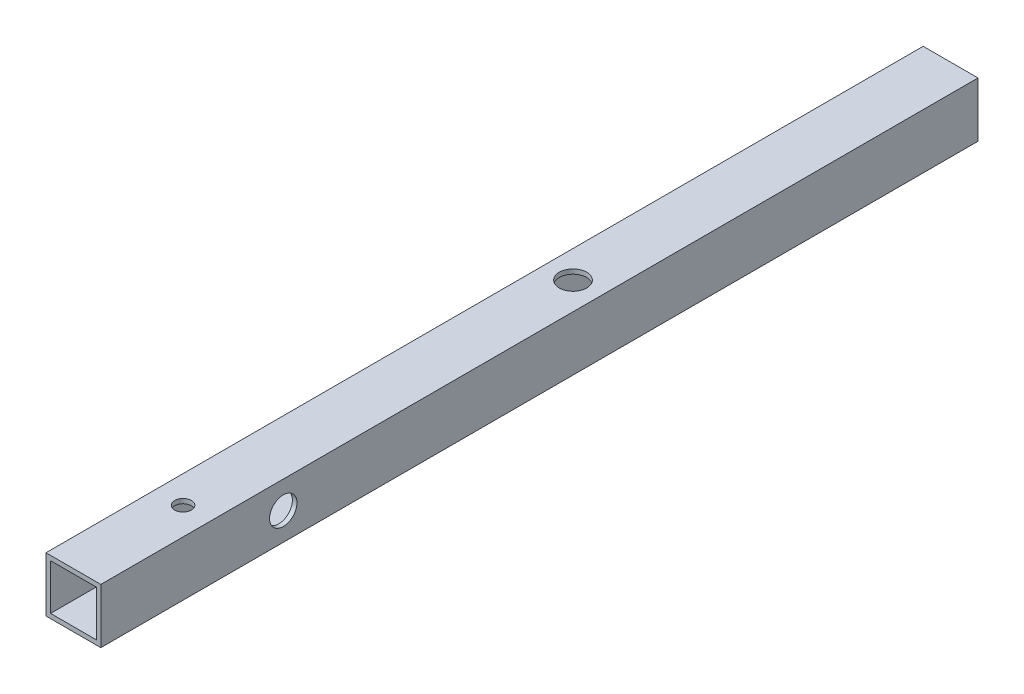
ISO-10303-21;
HEADER;
FILE_DESCRIPTION(('STEP AP214'),'2;1');
FILE_NAME('part.step','',(''),(''),'','','');
FILE_SCHEMA(('AUTOMOTIVE_DESIGN { 1 0 10303 214 1 1 1 1 }'));
ENDSEC;
DATA;
#1=APPLICATION_CONTEXT('core data for automotive mechanical design processes');
#2=APPLICATION_PROTOCOL_DEFINITION('international standard','automotive_design',2000,#1);
#3=PRODUCT_CONTEXT('',#1,'mechanical');
#4=PRODUCT('Part','Part','',(#3));
#5=PRODUCT_RELATED_PRODUCT_CATEGORY('part','',(#4));
#6=PRODUCT_DEFINITION_FORMATION('','',#4);
#7=PRODUCT_DEFINITION_CONTEXT('part definition',#1,'design');
#8=PRODUCT_DEFINITION('design','',#6,#7);
#9=PRODUCT_DEFINITION_SHAPE('','',#8);
#10=(LENGTH_UNIT() NAMED_UNIT(*) SI_UNIT(.MILLI.,.METRE.));
#11=(NAMED_UNIT(*) PLANE_ANGLE_UNIT() SI_UNIT($,.RADIAN.));
#12=(NAMED_UNIT(*) SI_UNIT($,.STERADIAN.) SOLID_ANGLE_UNIT());
#13=UNCERTAINTY_MEASURE_WITH_UNIT(LENGTH_MEASURE(1.E-05),#10,'distance_accuracy_value','');
#14=(GEOMETRIC_REPRESENTATION_CONTEXT(3) GLOBAL_UNCERTAINTY_ASSIGNED_CONTEXT((#13)) GLOBAL_UNIT_ASSIGNED_CONTEXT((#10,
#11,#12)) REPRESENTATION_CONTEXT('',''));
#15=CARTESIAN_POINT('',(0.,0.,0.));
#16=DIRECTION('',(0.,0.,1.));
#17=DIRECTION('',(1.,0.,0.));
#18=AXIS2_PLACEMENT_3D('',#15,#16,#17);
#19=CARTESIAN_POINT('',(0.,0.,152.4));
#20=DIRECTION('',(0.,0.,1.));
#21=DIRECTION('',(1.,0.,0.));
#22=AXIS2_PLACEMENT_3D('',#19,#20,#21);
#23=PLANE('',#22);
#24=DIRECTION('',(1.,0.,0.));
#25=VECTOR('',#24,1.);
#26=CARTESIAN_POINT('',(9.525,-9.525,152.4));
#27=LINE('',#26,#25);
#28=CARTESIAN_POINT('',(-9.525,-9.525,152.4));
#29=VERTEX_POINT('',#28);
#30=CARTESIAN_POINT('',(9.525,-9.525,152.4));
#31=VERTEX_POINT('',#30);
#32=EDGE_CURVE('E139',#29,#31,#27,.T.);
#33=ORIENTED_EDGE('',*,*,#32,.T.);
#34=DIRECTION('',(0.,1.,0.));
#35=VECTOR('',#34,1.);
#36=CARTESIAN_POINT('',(9.525,9.525,152.4));
#37=LINE('',#36,#35);
#38=CARTESIAN_POINT('',(9.525,9.525,152.4));
#39=VERTEX_POINT('',#38);
#40=EDGE_CURVE('E142',#31,#39,#37,.T.);
#41=ORIENTED_EDGE('',*,*,#40,.T.);
#42=DIRECTION('',(-1.,0.,0.));
#43=VECTOR('',#42,1.);
#44=CARTESIAN_POINT('',(9.525,9.525,152.4));
#45=LINE('',#44,#43);
#46=CARTESIAN_POINT('',(-9.525,9.525,152.4));
#47=VERTEX_POINT('',#46);
#48=EDGE_CURVE('E145',#39,#47,#45,.T.);
#49=ORIENTED_EDGE('',*,*,#48,.T.);
#50=DIRECTION('',(0.,-1.,0.));
#51=VECTOR('',#50,1.);
#52=CARTESIAN_POINT('',(-9.525,9.525,152.4));
#53=LINE('',#52,#51);
#54=EDGE_CURVE('E147',#47,#29,#53,.T.);
#55=ORIENTED_EDGE('',*,*,#54,.T.);
#56=EDGE_LOOP('',(#33,#41,#49,#55));
#57=FACE_BOUND('',#56,.T.);
#58=DIRECTION('',(0.,1.,0.));
#59=VECTOR('',#58,1.);
#60=CARTESIAN_POINT('',(7.9375,7.9375,152.4));
#61=LINE('',#60,#59);
#62=CARTESIAN_POINT('',(7.9375,-7.9375,152.4));
#63=VERTEX_POINT('',#62);
#64=CARTESIAN_POINT('',(7.9375,7.9375,152.4));
#65=VERTEX_POINT('',#64);
#66=EDGE_CURVE('E109',#63,#65,#61,.T.);
#67=ORIENTED_EDGE('',*,*,#66,.F.);
#68=DIRECTION('',(1.,0.,0.));
#69=VECTOR('',#68,1.);
#70=CARTESIAN_POINT('',(7.9375,-7.9375,152.4));
#71=LINE('',#70,#69);
#72=CARTESIAN_POINT('',(-7.9375,-7.9375,152.4));
#73=VERTEX_POINT('',#72);
#74=EDGE_CURVE('E101',#73,#63,#71,.T.);
#75=ORIENTED_EDGE('',*,*,#74,.F.);
#76=DIRECTION('',(0.,-1.,0.));
#77=VECTOR('',#76,1.);
#78=CARTESIAN_POINT('',(-7.9375,7.9375,152.4));
#79=LINE('',#78,#77);
#80=CARTESIAN_POINT('',(-7.9375,7.9375,152.4));
#81=VERTEX_POINT('',#80);
#82=EDGE_CURVE('E123',#81,#73,#79,.T.);
#83=ORIENTED_EDGE('',*,*,#82,.F.);
#84=DIRECTION('',(-1.,0.,0.));
#85=VECTOR('',#84,1.);
#86=CARTESIAN_POINT('',(7.9375,7.9375,152.4));
#87=LINE('',#86,#85);
#88=EDGE_CURVE('E121',#65,#81,#87,.T.);
#89=ORIENTED_EDGE('',*,*,#88,.F.);
#90=EDGE_LOOP('',(#67,#75,#83,#89));
#91=FACE_BOUND('',#90,.T.);
#92=ADVANCED_FACE('F35',(#57,#91),#23,.T.);
#93=CARTESIAN_POINT('',(0.,0.,-152.4));
#94=DIRECTION('',(0.,0.,1.));
#95=DIRECTION('',(1.,0.,0.));
#96=AXIS2_PLACEMENT_3D('',#93,#94,#95);
#97=PLANE('',#96);
#98=DIRECTION('',(1.,0.,0.));
#99=VECTOR('',#98,1.);
#100=CARTESIAN_POINT('',(9.525,-9.525,-152.4));
#101=LINE('',#100,#99);
#102=CARTESIAN_POINT('',(-9.525,-9.525,-152.4));
#103=VERTEX_POINT('',#102);
#104=CARTESIAN_POINT('',(9.525,-9.525,-152.4));
#105=VERTEX_POINT('',#104);
#106=EDGE_CURVE('E117',#103,#105,#101,.T.);
#107=ORIENTED_EDGE('',*,*,#106,.F.);
#108=DIRECTION('',(0.,-1.,0.));
#109=VECTOR('',#108,1.);
#110=CARTESIAN_POINT('',(-9.525,9.525,-152.4));
#111=LINE('',#110,#109);
#112=CARTESIAN_POINT('',(-9.525,9.525,-152.4));
#113=VERTEX_POINT('',#112);
#114=EDGE_CURVE('E143',#113,#103,#111,.T.);
#115=ORIENTED_EDGE('',*,*,#114,.F.);
#116=DIRECTION('',(-1.,0.,0.));
#117=VECTOR('',#116,1.);
#118=CARTESIAN_POINT('',(9.525,9.525,-152.4));
#119=LINE('',#118,#117);
#120=CARTESIAN_POINT('',(9.525,9.525,-152.4));
#121=VERTEX_POINT('',#120);
#122=EDGE_CURVE('E154',#121,#113,#119,.T.);
#123=ORIENTED_EDGE('',*,*,#122,.F.);
#124=DIRECTION('',(0.,1.,0.));
#125=VECTOR('',#124,1.);
#126=CARTESIAN_POINT('',(9.525,9.525,-152.4));
#127=LINE('',#126,#125);
#128=EDGE_CURVE('E152',#105,#121,#127,.T.);
#129=ORIENTED_EDGE('',*,*,#128,.F.);
#130=EDGE_LOOP('',(#107,#115,#123,#129));
#131=FACE_BOUND('',#130,.T.);
#132=DIRECTION('',(1.,0.,0.));
#133=VECTOR('',#132,1.);
#134=CARTESIAN_POINT('',(7.9375,-7.9375,-152.4));
#135=LINE('',#134,#133);
#136=CARTESIAN_POINT('',(-7.9375,-7.9375,-152.4));
#137=VERTEX_POINT('',#136);
#138=CARTESIAN_POINT('',(7.9375,-7.9375,-152.4));
#139=VERTEX_POINT('',#138);
#140=EDGE_CURVE('E59',#137,#139,#135,.T.);
#141=ORIENTED_EDGE('',*,*,#140,.T.);
#142=DIRECTION('',(0.,1.,0.));
#143=VECTOR('',#142,1.);
#144=CARTESIAN_POINT('',(7.9375,7.9375,-152.4));
#145=LINE('',#144,#143);
#146=CARTESIAN_POINT('',(7.9375,7.9375,-152.4));
#147=VERTEX_POINT('',#146);
#148=EDGE_CURVE('E116',#139,#147,#145,.T.);
#149=ORIENTED_EDGE('',*,*,#148,.T.);
#150=DIRECTION('',(-1.,0.,0.));
#151=VECTOR('',#150,1.);
#152=CARTESIAN_POINT('',(7.9375,7.9375,-152.4));
#153=LINE('',#152,#151);
#154=CARTESIAN_POINT('',(-7.9375,7.9375,-152.4));
#155=VERTEX_POINT('',#154);
#156=EDGE_CURVE('E131',#147,#155,#153,.T.);
#157=ORIENTED_EDGE('',*,*,#156,.T.);
#158=DIRECTION('',(0.,-1.,0.));
#159=VECTOR('',#158,1.);
#160=CARTESIAN_POINT('',(-7.9375,7.9375,-152.4));
#161=LINE('',#160,#159);
#162=EDGE_CURVE('E110',#155,#137,#161,.T.);
#163=ORIENTED_EDGE('',*,*,#162,.T.);
#164=EDGE_LOOP('',(#141,#149,#157,#163));
#165=FACE_BOUND('',#164,.T.);
#166=ADVANCED_FACE('F173',(#131,#165),#97,.F.);
#167=CARTESIAN_POINT('',(9.525,-9.525,152.4));
#168=DIRECTION('',(0.,1.,0.));
#169=DIRECTION('',(-1.,0.,0.));
#170=AXIS2_PLACEMENT_3D('',#167,#168,#169);
#171=PLANE('',#170);
#172=CARTESIAN_POINT('',(0.,-9.52500000000001,114.3));
#173=DIRECTION('',(0.,1.,0.));
#174=DIRECTION('',(-1.,0.,0.));
#175=AXIS2_PLACEMENT_3D('',#172,#173,#174);
#176=CIRCLE('',#175,2.8956);
#177=CARTESIAN_POINT('',(-2.8956,-9.52500000000001,114.3));
#178=VERTEX_POINT('',#177);
#179=EDGE_CURVE('E217',#178,#178,#176,.T.);
#180=ORIENTED_EDGE('',*,*,#179,.T.);
#181=EDGE_LOOP('',(#180));
#182=FACE_BOUND('',#181,.T.);
#183=ORIENTED_EDGE('',*,*,#106,.T.);
#184=DIRECTION('',(0.,0.,-1.));
#185=VECTOR('',#184,1.);
#186=CARTESIAN_POINT('',(9.525,-9.525,152.4));
#187=LINE('',#186,#185);
#188=EDGE_CURVE('E11',#31,#105,#187,.T.);
#189=ORIENTED_EDGE('',*,*,#188,.F.);
#190=ORIENTED_EDGE('',*,*,#32,.F.);
#191=DIRECTION('',(0.,0.,-1.));
#192=VECTOR('',#191,1.);
#193=CARTESIAN_POINT('',(-9.525,-9.525,152.4));
#194=LINE('',#193,#192);
#195=EDGE_CURVE('E149',#29,#103,#194,.T.);
#196=ORIENTED_EDGE('',*,*,#195,.T.);
#197=EDGE_LOOP('',(#183,#189,#190,#196));
#198=FACE_BOUND('',#197,.T.);
#199=ADVANCED_FACE('F37',(#182,#198),#171,.F.);
#200=CARTESIAN_POINT('',(9.525,9.525,152.4));
#201=DIRECTION('',(-1.,0.,0.));
#202=DIRECTION('',(0.,0.,1.));
#203=AXIS2_PLACEMENT_3D('',#200,#201,#202);
#204=PLANE('',#203);
#205=CARTESIAN_POINT('',(9.525,0.,89.0016));
#206=DIRECTION('',(1.,0.,0.));
#207=DIRECTION('',(0.,0.,-1.));
#208=AXIS2_PLACEMENT_3D('',#205,#206,#207);
#209=CIRCLE('',#208,4.7625);
#210=CARTESIAN_POINT('',(9.525,0.,84.2391));
#211=VERTEX_POINT('',#210);
#212=EDGE_CURVE('E260',#211,#211,#209,.T.);
#213=ORIENTED_EDGE('',*,*,#212,.F.);
#214=EDGE_LOOP('',(#213));
#215=FACE_BOUND('',#214,.T.);
#216=ORIENTED_EDGE('',*,*,#128,.T.);
#217=DIRECTION('',(0.,0.,-1.));
#218=VECTOR('',#217,1.);
#219=CARTESIAN_POINT('',(9.525,9.525,152.4));
#220=LINE('',#219,#218);
#221=EDGE_CURVE('E44',#39,#121,#220,.T.);
#222=ORIENTED_EDGE('',*,*,#221,.F.);
#223=ORIENTED_EDGE('',*,*,#40,.F.);
#224=ORIENTED_EDGE('',*,*,#188,.T.);
#225=EDGE_LOOP('',(#216,#222,#223,#224));
#226=FACE_BOUND('',#225,.T.);
#227=ADVANCED_FACE('F183',(#215,#226),#204,.F.);
#228=CARTESIAN_POINT('',(9.525,9.525,152.4));
#229=DIRECTION('',(0.,-1.,0.));
#230=DIRECTION('',(1.,0.,0.));
#231=AXIS2_PLACEMENT_3D('',#228,#229,#230);
#232=PLANE('',#231);
#233=CARTESIAN_POINT('',(0.,9.525,-21.2005333333333));
#234=DIRECTION('',(0.,1.,0.));
#235=DIRECTION('',(-1.,0.,0.));
#236=AXIS2_PLACEMENT_3D('',#233,#234,#235);
#237=CIRCLE('',#236,4.7625);
#238=CARTESIAN_POINT('',(-4.76250000000001,9.525,-21.2005333333333));
#239=VERTEX_POINT('',#238);
#240=EDGE_CURVE('E220',#239,#239,#237,.T.);
#241=ORIENTED_EDGE('',*,*,#240,.F.);
#242=EDGE_LOOP('',(#241));
#243=FACE_BOUND('',#242,.T.);
#244=CARTESIAN_POINT('',(0.,9.525,114.3));
#245=DIRECTION('',(0.,1.,0.));
#246=DIRECTION('',(-1.,0.,0.));
#247=AXIS2_PLACEMENT_3D('',#244,#245,#246);
#248=CIRCLE('',#247,2.8956);
#249=CARTESIAN_POINT('',(-2.8956,9.525,114.3));
#250=VERTEX_POINT('',#249);
#251=EDGE_CURVE('E213',#250,#250,#248,.T.);
#252=ORIENTED_EDGE('',*,*,#251,.F.);
#253=EDGE_LOOP('',(#252));
#254=FACE_BOUND('',#253,.T.);
#255=ORIENTED_EDGE('',*,*,#122,.T.);
#256=DIRECTION('',(0.,0.,-1.));
#257=VECTOR('',#256,1.);
#258=CARTESIAN_POINT('',(-9.525,9.525,152.4));
#259=LINE('',#258,#257);
#260=EDGE_CURVE('E159',#47,#113,#259,.T.);
#261=ORIENTED_EDGE('',*,*,#260,.F.);
#262=ORIENTED_EDGE('',*,*,#48,.F.);
#263=ORIENTED_EDGE('',*,*,#221,.T.);
#264=EDGE_LOOP('',(#255,#261,#262,#263));
#265=FACE_BOUND('',#264,.T.);
#266=ADVANCED_FACE('F167',(#243,#254,#265),#232,.F.);
#267=CARTESIAN_POINT('',(-9.525,9.525,152.4));
#268=DIRECTION('',(1.,0.,0.));
#269=DIRECTION('',(0.,0.,-1.));
#270=AXIS2_PLACEMENT_3D('',#267,#268,#269);
#271=PLANE('',#270);
#272=CARTESIAN_POINT('',(-9.525,0.,-44.45));
#273=DIRECTION('',(-1.,0.,0.));
#274=DIRECTION('',(0.,0.,1.));
#275=AXIS2_PLACEMENT_3D('',#272,#273,#274);
#276=CIRCLE('',#275,4.7625);
#277=CARTESIAN_POINT('',(-9.525,0.,-39.6875));
#278=VERTEX_POINT('',#277);
#279=EDGE_CURVE('E211',#278,#278,#276,.T.);
#280=ORIENTED_EDGE('',*,*,#279,.F.);
#281=EDGE_LOOP('',(#280));
#282=FACE_BOUND('',#281,.T.);
#283=ORIENTED_EDGE('',*,*,#114,.T.);
#284=ORIENTED_EDGE('',*,*,#195,.F.);
#285=ORIENTED_EDGE('',*,*,#54,.F.);
#286=ORIENTED_EDGE('',*,*,#260,.T.);
#287=EDGE_LOOP('',(#283,#284,#285,#286));
#288=FACE_BOUND('',#287,.T.);
#289=ADVANCED_FACE('F177',(#282,#288),#271,.F.);
#290=CARTESIAN_POINT('',(7.9375,-7.9375,152.4));
#291=DIRECTION('',(0.,1.,0.));
#292=DIRECTION('',(-1.,0.,0.));
#293=AXIS2_PLACEMENT_3D('',#290,#291,#292);
#294=PLANE('',#293);
#295=CARTESIAN_POINT('',(0.,-7.9375,114.3));
#296=DIRECTION('',(0.,1.,0.));
#297=DIRECTION('',(-1.,0.,0.));
#298=AXIS2_PLACEMENT_3D('',#295,#296,#297);
#299=CIRCLE('',#298,2.8956);
#300=CARTESIAN_POINT('',(-2.8956,-7.9375,114.3));
#301=VERTEX_POINT('',#300);
#302=EDGE_CURVE('E129',#301,#301,#299,.T.);
#303=ORIENTED_EDGE('',*,*,#302,.F.);
#304=EDGE_LOOP('',(#303));
#305=FACE_BOUND('',#304,.T.);
#306=ORIENTED_EDGE('',*,*,#140,.F.);
#307=DIRECTION('',(0.,0.,-1.));
#308=VECTOR('',#307,1.);
#309=CARTESIAN_POINT('',(-7.9375,-7.9375,152.4));
#310=LINE('',#309,#308);
#311=EDGE_CURVE('E105',#73,#137,#310,.T.);
#312=ORIENTED_EDGE('',*,*,#311,.F.);
#313=ORIENTED_EDGE('',*,*,#74,.T.);
#314=DIRECTION('',(0.,0.,-1.));
#315=VECTOR('',#314,1.);
#316=CARTESIAN_POINT('',(7.9375,-7.9375,152.4));
#317=LINE('',#316,#315);
#318=EDGE_CURVE('E104',#63,#139,#317,.T.);
#319=ORIENTED_EDGE('',*,*,#318,.T.);
#320=EDGE_LOOP('',(#306,#312,#313,#319));
#321=FACE_BOUND('',#320,.T.);
#322=ADVANCED_FACE('F103',(#305,#321),#294,.T.);
#323=CARTESIAN_POINT('',(7.9375,7.9375,152.4));
#324=DIRECTION('',(-1.,0.,0.));
#325=DIRECTION('',(0.,0.,1.));
#326=AXIS2_PLACEMENT_3D('',#323,#324,#325);
#327=PLANE('',#326);
#328=CARTESIAN_POINT('',(7.9375,0.,89.0016));
#329=DIRECTION('',(-1.,0.,0.));
#330=DIRECTION('',(0.,0.,1.));
#331=AXIS2_PLACEMENT_3D('',#328,#329,#330);
#332=CIRCLE('',#331,4.7625);
#333=CARTESIAN_POINT('',(7.9375,0.,93.7641));
#334=VERTEX_POINT('',#333);
#335=EDGE_CURVE('E258',#334,#334,#332,.F.);
#336=ORIENTED_EDGE('',*,*,#335,.T.);
#337=EDGE_LOOP('',(#336));
#338=FACE_BOUND('',#337,.T.);
#339=ORIENTED_EDGE('',*,*,#148,.F.);
#340=ORIENTED_EDGE('',*,*,#318,.F.);
#341=ORIENTED_EDGE('',*,*,#66,.T.);
#342=DIRECTION('',(0.,0.,-1.));
#343=VECTOR('',#342,1.);
#344=CARTESIAN_POINT('',(7.9375,7.9375,152.4));
#345=LINE('',#344,#343);
#346=EDGE_CURVE('E118',#65,#147,#345,.T.);
#347=ORIENTED_EDGE('',*,*,#346,.T.);
#348=EDGE_LOOP('',(#339,#340,#341,#347));
#349=FACE_BOUND('',#348,.T.);
#350=ADVANCED_FACE('F113',(#338,#349),#327,.T.);
#351=CARTESIAN_POINT('',(7.9375,7.9375,152.4));
#352=DIRECTION('',(0.,-1.,0.));
#353=DIRECTION('',(1.,0.,0.));
#354=AXIS2_PLACEMENT_3D('',#351,#352,#353);
#355=PLANE('',#354);
#356=CARTESIAN_POINT('',(0.,7.9375,-21.2005333333333));
#357=DIRECTION('',(0.,-1.,0.));
#358=DIRECTION('',(1.,0.,0.));
#359=AXIS2_PLACEMENT_3D('',#356,#357,#358);
#360=CIRCLE('',#359,4.7625);
#361=CARTESIAN_POINT('',(4.7625,7.9375,-21.2005333333333));
#362=VERTEX_POINT('',#361);
#363=EDGE_CURVE('E223',#362,#362,#360,.F.);
#364=ORIENTED_EDGE('',*,*,#363,.T.);
#365=EDGE_LOOP('',(#364));
#366=FACE_BOUND('',#365,.T.);
#367=CARTESIAN_POINT('',(0.,7.9375,114.3));
#368=DIRECTION('',(0.,-1.,0.));
#369=DIRECTION('',(1.,0.,0.));
#370=AXIS2_PLACEMENT_3D('',#367,#368,#369);
#371=CIRCLE('',#370,2.8956);
#372=CARTESIAN_POINT('',(2.8956,7.9375,114.3));
#373=VERTEX_POINT('',#372);
#374=EDGE_CURVE('E39',#373,#373,#371,.T.);
#375=ORIENTED_EDGE('',*,*,#374,.F.);
#376=EDGE_LOOP('',(#375));
#377=FACE_BOUND('',#376,.T.);
#378=ORIENTED_EDGE('',*,*,#156,.F.);
#379=ORIENTED_EDGE('',*,*,#346,.F.);
#380=ORIENTED_EDGE('',*,*,#88,.T.);
#381=DIRECTION('',(0.,0.,-1.));
#382=VECTOR('',#381,1.);
#383=CARTESIAN_POINT('',(-7.9375,7.9375,152.4));
#384=LINE('',#383,#382);
#385=EDGE_CURVE('E51',#81,#155,#384,.T.);
#386=ORIENTED_EDGE('',*,*,#385,.T.);
#387=EDGE_LOOP('',(#378,#379,#380,#386));
#388=FACE_BOUND('',#387,.T.);
#389=ADVANCED_FACE('F236',(#366,#377,#388),#355,.T.);
#390=CARTESIAN_POINT('',(-7.9375,7.9375,152.4));
#391=DIRECTION('',(1.,0.,0.));
#392=DIRECTION('',(0.,0.,-1.));
#393=AXIS2_PLACEMENT_3D('',#390,#391,#392);
#394=PLANE('',#393);
#395=CARTESIAN_POINT('',(-7.9375,0.,-44.45));
#396=DIRECTION('',(1.,0.,0.));
#397=DIRECTION('',(0.,0.,-1.));
#398=AXIS2_PLACEMENT_3D('',#395,#396,#397);
#399=CIRCLE('',#398,4.7625);
#400=CARTESIAN_POINT('',(-7.9375,0.,-49.2125));
#401=VERTEX_POINT('',#400);
#402=EDGE_CURVE('E214',#401,#401,#399,.F.);
#403=ORIENTED_EDGE('',*,*,#402,.T.);
#404=EDGE_LOOP('',(#403));
#405=FACE_BOUND('',#404,.T.);
#406=ORIENTED_EDGE('',*,*,#162,.F.);
#407=ORIENTED_EDGE('',*,*,#385,.F.);
#408=ORIENTED_EDGE('',*,*,#82,.T.);
#409=ORIENTED_EDGE('',*,*,#311,.T.);
#410=EDGE_LOOP('',(#406,#407,#408,#409));
#411=FACE_BOUND('',#410,.T.);
#412=ADVANCED_FACE('F239',(#405,#411),#394,.T.);
#413=CARTESIAN_POINT('',(0.,-9.52500000000001,114.3));
#414=DIRECTION('',(0.,1.,0.));
#415=DIRECTION('',(-1.,0.,0.));
#416=AXIS2_PLACEMENT_3D('',#413,#414,#415);
#417=CYLINDRICAL_SURFACE('',#416,2.8956);
#418=ORIENTED_EDGE('',*,*,#374,.T.);
#419=EDGE_LOOP('',(#418));
#420=FACE_BOUND('',#419,.T.);
#421=ORIENTED_EDGE('',*,*,#251,.T.);
#422=EDGE_LOOP('',(#421));
#423=FACE_BOUND('',#422,.T.);
#424=ADVANCED_FACE('F233',(#420,#423),#417,.F.);
#425=ORIENTED_EDGE('',*,*,#302,.T.);
#426=EDGE_LOOP('',(#425));
#427=FACE_BOUND('',#426,.T.);
#428=ORIENTED_EDGE('',*,*,#179,.F.);
#429=EDGE_LOOP('',(#428));
#430=FACE_BOUND('',#429,.T.);
#431=ADVANCED_FACE('F249',(#427,#430),#417,.F.);
#432=CARTESIAN_POINT('',(9.526,0.,-44.45));
#433=DIRECTION('',(-1.,0.,0.));
#434=DIRECTION('',(0.,0.,1.));
#435=AXIS2_PLACEMENT_3D('',#432,#433,#434);
#436=CYLINDRICAL_SURFACE('',#435,4.7625);
#437=ORIENTED_EDGE('',*,*,#402,.F.);
#438=EDGE_LOOP('',(#437));
#439=FACE_BOUND('',#438,.T.);
#440=ORIENTED_EDGE('',*,*,#279,.T.);
#441=EDGE_LOOP('',(#440));
#442=FACE_BOUND('',#441,.T.);
#443=ADVANCED_FACE('F273',(#439,#442),#436,.F.);
#444=CARTESIAN_POINT('',(0.,-9.52600000000001,-21.2005333333333));
#445=DIRECTION('',(0.,1.,0.));
#446=DIRECTION('',(-1.,0.,0.));
#447=AXIS2_PLACEMENT_3D('',#444,#445,#446);
#448=CYLINDRICAL_SURFACE('',#447,4.7625);
#449=ORIENTED_EDGE('',*,*,#363,.F.);
#450=EDGE_LOOP('',(#449));
#451=FACE_BOUND('',#450,.T.);
#452=ORIENTED_EDGE('',*,*,#240,.T.);
#453=EDGE_LOOP('',(#452));
#454=FACE_BOUND('',#453,.T.);
#455=ADVANCED_FACE('F270',(#451,#454),#448,.F.);
#456=CARTESIAN_POINT('',(-9.526,0.,89.0016));
#457=DIRECTION('',(1.,0.,0.));
#458=DIRECTION('',(0.,0.,-1.));
#459=AXIS2_PLACEMENT_3D('',#456,#457,#458);
#460=CYLINDRICAL_SURFACE('',#459,4.7625);
#461=ORIENTED_EDGE('',*,*,#335,.F.);
#462=EDGE_LOOP('',(#461));
#463=FACE_BOUND('',#462,.T.);
#464=ORIENTED_EDGE('',*,*,#212,.T.);
#465=EDGE_LOOP('',(#464));
#466=FACE_BOUND('',#465,.T.);
#467=ADVANCED_FACE('F272',(#463,#466),#460,.F.);
#468=CLOSED_SHELL('',(#92,#166,#199,#227,#266,#289,#322,#350,#389,#412,#424,#431,#443,#455,#467));
#469=MANIFOLD_SOLID_BREP('B2',#468);
#470=ADVANCED_BREP_SHAPE_REPRESENTATION('',(#18,#469),#14);
#471=SHAPE_DEFINITION_REPRESENTATION(#9,#470);
ENDSEC;
END-ISO-10303-21;
